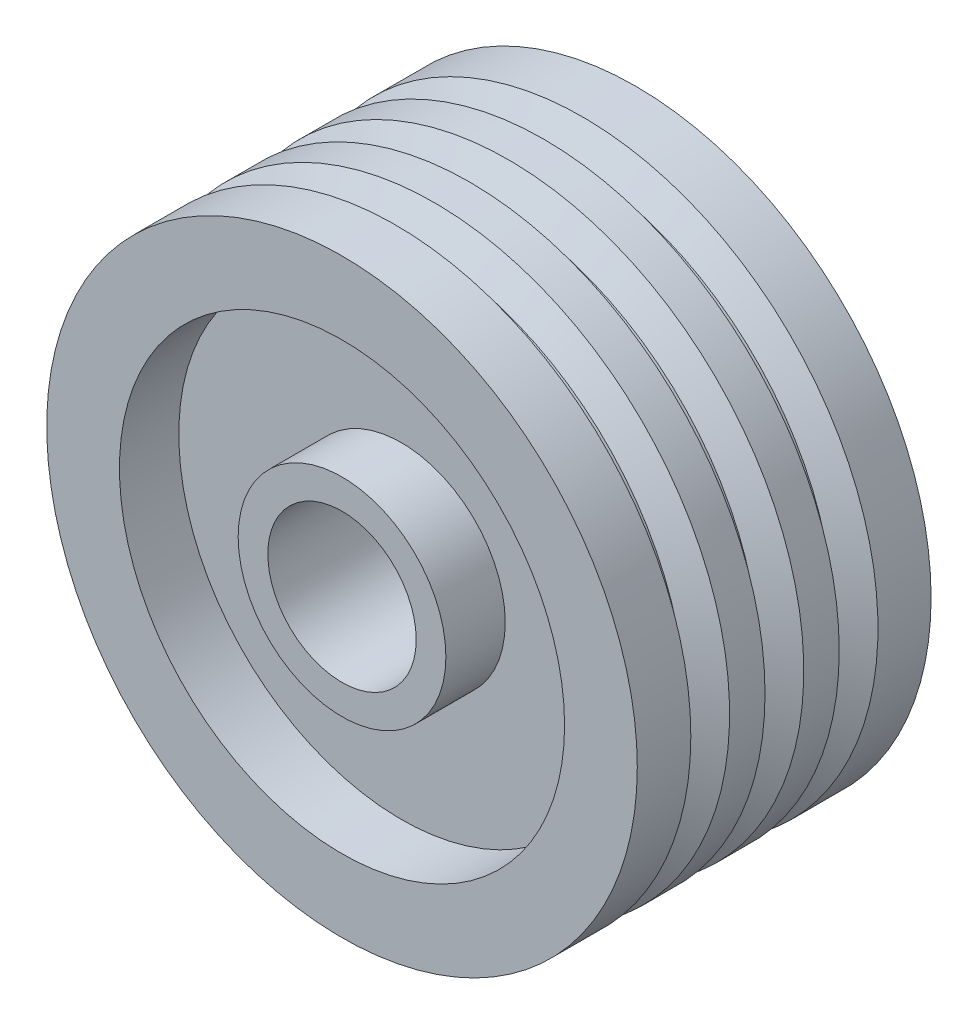
ISO-10303-21;
HEADER;
FILE_DESCRIPTION(('STEP AP214'),'2;1');
FILE_NAME('part.step','',(''),(''),'','','');
FILE_SCHEMA(('AUTOMOTIVE_DESIGN { 1 0 10303 214 1 1 1 1 }'));
ENDSEC;
DATA;
#1=APPLICATION_CONTEXT('core data for automotive mechanical design processes');
#2=APPLICATION_PROTOCOL_DEFINITION('international standard','automotive_design',2000,#1);
#3=PRODUCT_CONTEXT('',#1,'mechanical');
#4=PRODUCT('Part','Part','',(#3));
#5=PRODUCT_RELATED_PRODUCT_CATEGORY('part','',(#4));
#6=PRODUCT_DEFINITION_FORMATION('','',#4);
#7=PRODUCT_DEFINITION_CONTEXT('part definition',#1,'design');
#8=PRODUCT_DEFINITION('design','',#6,#7);
#9=PRODUCT_DEFINITION_SHAPE('','',#8);
#10=(LENGTH_UNIT() NAMED_UNIT(*) SI_UNIT(.MILLI.,.METRE.));
#11=(NAMED_UNIT(*) PLANE_ANGLE_UNIT() SI_UNIT($,.RADIAN.));
#12=(NAMED_UNIT(*) SI_UNIT($,.STERADIAN.) SOLID_ANGLE_UNIT());
#13=UNCERTAINTY_MEASURE_WITH_UNIT(LENGTH_MEASURE(1.E-05),#10,'distance_accuracy_value','');
#14=(GEOMETRIC_REPRESENTATION_CONTEXT(3) GLOBAL_UNCERTAINTY_ASSIGNED_CONTEXT((#13)) GLOBAL_UNIT_ASSIGNED_CONTEXT((#10,
#11,#12)) REPRESENTATION_CONTEXT('',''));
#15=CARTESIAN_POINT('',(0.,0.,0.));
#16=DIRECTION('',(0.,0.,1.));
#17=DIRECTION('',(1.,0.,0.));
#18=AXIS2_PLACEMENT_3D('',#15,#16,#17);
#19=CARTESIAN_POINT('',(0.,0.,49.5));
#20=DIRECTION('',(0.,0.,1.));
#21=DIRECTION('',(1.,0.,0.));
#22=AXIS2_PLACEMENT_3D('',#19,#20,#21);
#23=PLANE('',#22);
#24=CARTESIAN_POINT('',(0.,0.,49.5));
#25=DIRECTION('',(0.,0.,1.));
#26=DIRECTION('',(1.,0.,0.));
#27=AXIS2_PLACEMENT_3D('',#24,#25,#26);
#28=CIRCLE('',#27,25.);
#29=CARTESIAN_POINT('',(25.,0.,49.5));
#30=VERTEX_POINT('',#29);
#31=EDGE_CURVE('E139',#30,#30,#28,.T.);
#32=ORIENTED_EDGE('',*,*,#31,.F.);
#33=EDGE_LOOP('',(#32));
#34=FACE_BOUND('',#33,.T.);
#35=CARTESIAN_POINT('',(0.,0.,49.5));
#36=DIRECTION('',(0.,0.,1.));
#37=DIRECTION('',(1.,0.,0.));
#38=AXIS2_PLACEMENT_3D('',#35,#36,#37);
#39=CIRCLE('',#38,35.);
#40=CARTESIAN_POINT('',(35.,0.,49.5));
#41=VERTEX_POINT('',#40);
#42=EDGE_CURVE('E326',#41,#41,#39,.T.);
#43=ORIENTED_EDGE('',*,*,#42,.T.);
#44=EDGE_LOOP('',(#43));
#45=FACE_BOUND('',#44,.T.);
#46=ADVANCED_FACE('F32',(#34,#45),#23,.T.);
#47=CARTESIAN_POINT('',(0.,0.,49.5));
#48=DIRECTION('',(0.,0.,-1.));
#49=DIRECTION('',(-1.,0.,0.));
#50=AXIS2_PLACEMENT_3D('',#47,#48,#49);
#51=CYLINDRICAL_SURFACE('',#50,99.5);
#52=CARTESIAN_POINT('',(3.27580052842238E-13,0.,31.4581190718746));
#53=DIRECTION('',(0.,0.,1.));
#54=DIRECTION('',(1.,0.,0.));
#55=AXIS2_PLACEMENT_3D('',#52,#53,#54);
#56=CIRCLE('',#55,99.5);
#57=CARTESIAN_POINT('',(99.5000000000004,0.,31.4581190718735));
#58=VERTEX_POINT('',#57);
#59=EDGE_CURVE('E36',#58,#58,#56,.T.);
#60=ORIENTED_EDGE('',*,*,#59,.T.);
#61=EDGE_LOOP('',(#60));
#62=FACE_BOUND('',#61,.T.);
#63=CARTESIAN_POINT('',(0.,0.,49.5));
#64=DIRECTION('',(0.,0.,1.));
#65=DIRECTION('',(1.,0.,0.));
#66=AXIS2_PLACEMENT_3D('',#63,#64,#65);
#67=CIRCLE('',#66,99.5);
#68=CARTESIAN_POINT('',(99.5,0.,49.5));
#69=VERTEX_POINT('',#68);
#70=EDGE_CURVE('E10',#69,#69,#67,.T.);
#71=ORIENTED_EDGE('',*,*,#70,.F.);
#72=EDGE_LOOP('',(#71));
#73=FACE_BOUND('',#72,.T.);
#74=ADVANCED_FACE('F68',(#62,#73),#51,.T.);
#75=CARTESIAN_POINT('',(0.,0.,49.5));
#76=DIRECTION('',(0.,0.,1.));
#77=DIRECTION('',(1.,0.,0.));
#78=AXIS2_PLACEMENT_3D('',#75,#76,#77);
#79=CIRCLE('',#78,75.);
#80=CARTESIAN_POINT('',(75.,0.,49.5));
#81=VERTEX_POINT('',#80);
#82=EDGE_CURVE('E328',#81,#81,#79,.T.);
#83=ORIENTED_EDGE('',*,*,#82,.F.);
#84=EDGE_LOOP('',(#83));
#85=FACE_BOUND('',#84,.T.);
#86=ORIENTED_EDGE('',*,*,#70,.T.);
#87=EDGE_LOOP('',(#86));
#88=FACE_BOUND('',#87,.T.);
#89=ADVANCED_FACE('F74',(#85,#88),#23,.T.);
#90=CARTESIAN_POINT('',(3.30046354231417E-13,0.,31.6949625612591));
#91=DIRECTION('',(0.,0.,1.));
#92=DIRECTION('',(1.,0.,0.));
#93=AXIS2_PLACEMENT_3D('',#90,#91,#92);
#94=CONICAL_SURFACE('',#93,99.9117221224561,1.04877356801093);
#95=CARTESIAN_POINT('',(2.70564923737574E-13,0.,25.9828506460018));
#96=DIRECTION('',(0.,0.,-1.));
#97=DIRECTION('',(-1.,0.,0.));
#98=AXIS2_PLACEMENT_3D('',#95,#96,#97);
#99=CIRCLE('',#98,89.9819459332608);
#100=CARTESIAN_POINT('',(-89.9819459332605,0.,25.9828506460028));
#101=VERTEX_POINT('',#100);
#102=EDGE_CURVE('E157',#101,#101,#99,.T.);
#103=ORIENTED_EDGE('',*,*,#102,.F.);
#104=EDGE_LOOP('',(#103));
#105=FACE_BOUND('',#104,.T.);
#106=ORIENTED_EDGE('',*,*,#59,.F.);
#107=EDGE_LOOP('',(#106));
#108=FACE_BOUND('',#107,.T.);
#109=ADVANCED_FACE('F71',(#105,#108),#94,.T.);
#110=CARTESIAN_POINT('',(2.48811607737429E-13,0.,23.8938394287339));
#111=DIRECTION('',(0.,0.,-1.));
#112=DIRECTION('',(-1.,0.,0.));
#113=AXIS2_PLACEMENT_3D('',#110,#111,#112);
#114=CONICAL_SURFACE('',#113,90.0180540681299,1.04562153425965);
#115=CARTESIAN_POINT('',(2.48811607737429E-13,0.,23.8938394287339));
#116=DIRECTION('',(0.,0.,-1.));
#117=DIRECTION('',(-1.,0.,0.));
#118=AXIS2_PLACEMENT_3D('',#115,#116,#117);
#119=CIRCLE('',#118,90.0180540681299);
#120=CARTESIAN_POINT('',(-90.0180540681296,0.,23.8938394287349));
#121=VERTEX_POINT('',#120);
#122=EDGE_CURVE('E150',#121,#121,#119,.T.);
#123=ORIENTED_EDGE('',*,*,#122,.T.);
#124=EDGE_LOOP('',(#123));
#125=FACE_BOUND('',#124,.T.);
#126=CARTESIAN_POINT('',(1.91597807919002E-13,0.,18.3994922863294));
#127=DIRECTION('',(0.,0.,-1.));
#128=DIRECTION('',(-1.,0.,0.));
#129=AXIS2_PLACEMENT_3D('',#126,#127,#128);
#130=CIRCLE('',#129,99.5);
#131=CARTESIAN_POINT('',(-99.4999999999998,0.,18.3994922863304));
#132=VERTEX_POINT('',#131);
#133=EDGE_CURVE('E61',#132,#132,#130,.T.);
#134=ORIENTED_EDGE('',*,*,#133,.F.);
#135=EDGE_LOOP('',(#134));
#136=FACE_BOUND('',#135,.T.);
#137=ADVANCED_FACE('F73',(#125,#136),#114,.T.);
#138=CARTESIAN_POINT('',(2.70564923737574E-13,0.,25.9828506460018));
#139=DIRECTION('',(0.,0.,-1.));
#140=DIRECTION('',(-1.,0.,0.));
#141=AXIS2_PLACEMENT_3D('',#138,#139,#140);
#142=CONICAL_SURFACE('',#141,89.9819459332608,0.0172830759718585);
#143=ORIENTED_EDGE('',*,*,#122,.F.);
#144=EDGE_LOOP('',(#143));
#145=FACE_BOUND('',#144,.T.);
#146=ORIENTED_EDGE('',*,*,#102,.T.);
#147=EDGE_LOOP('',(#146));
#148=FACE_BOUND('',#147,.T.);
#149=ADVANCED_FACE('F81',(#145,#148),#142,.T.);
#150=ORIENTED_EDGE('',*,*,#133,.T.);
#151=EDGE_LOOP('',(#150));
#152=FACE_BOUND('',#151,.T.);
#153=CARTESIAN_POINT('',(0.,0.,6.45811907214413));
#154=DIRECTION('',(0.,0.,1.));
#155=DIRECTION('',(1.,0.,0.));
#156=AXIS2_PLACEMENT_3D('',#153,#154,#155);
#157=CIRCLE('',#156,99.5);
#158=CARTESIAN_POINT('',(99.5000000000001,0.,6.45811907214309));
#159=VERTEX_POINT('',#158);
#160=EDGE_CURVE('E53',#159,#159,#157,.T.);
#161=ORIENTED_EDGE('',*,*,#160,.T.);
#162=EDGE_LOOP('',(#161));
#163=FACE_BOUND('',#162,.T.);
#164=ADVANCED_FACE('F110',(#152,#163),#51,.T.);
#165=CARTESIAN_POINT('',(0.,0.,6.69496256152854));
#166=DIRECTION('',(0.,0.,1.));
#167=DIRECTION('',(1.,0.,0.));
#168=AXIS2_PLACEMENT_3D('',#165,#166,#167);
#169=CONICAL_SURFACE('',#168,99.9117221224559,1.04877356801093);
#170=CARTESIAN_POINT('',(0.,0.,0.982850646271287));
#171=DIRECTION('',(0.,0.,-1.));
#172=DIRECTION('',(-1.,0.,0.));
#173=AXIS2_PLACEMENT_3D('',#170,#171,#172);
#174=CIRCLE('',#173,89.9819459332606);
#175=CARTESIAN_POINT('',(-89.9819459332606,0.,0.982850646272224));
#176=VERTEX_POINT('',#175);
#177=EDGE_CURVE('E47',#176,#176,#174,.T.);
#178=ORIENTED_EDGE('',*,*,#177,.F.);
#179=EDGE_LOOP('',(#178));
#180=FACE_BOUND('',#179,.T.);
#181=ORIENTED_EDGE('',*,*,#160,.F.);
#182=EDGE_LOOP('',(#181));
#183=FACE_BOUND('',#182,.T.);
#184=ADVANCED_FACE('F171',(#180,#183),#169,.T.);
#185=CARTESIAN_POINT('',(0.,0.,-1.10616057125737));
#186=DIRECTION('',(0.,0.,-1.));
#187=DIRECTION('',(-1.,0.,0.));
#188=AXIS2_PLACEMENT_3D('',#185,#186,#187);
#189=CONICAL_SURFACE('',#188,90.0180540681253,1.04562153425909);
#190=CARTESIAN_POINT('',(0.,0.,-1.10616057125737));
#191=DIRECTION('',(0.,0.,-1.));
#192=DIRECTION('',(-1.,0.,0.));
#193=AXIS2_PLACEMENT_3D('',#190,#191,#192);
#194=CIRCLE('',#193,90.0180540681253);
#195=CARTESIAN_POINT('',(-90.0180540681253,0.,-1.10616057125643));
#196=VERTEX_POINT('',#195);
#197=EDGE_CURVE('E160',#196,#196,#194,.T.);
#198=ORIENTED_EDGE('',*,*,#197,.T.);
#199=EDGE_LOOP('',(#198));
#200=FACE_BOUND('',#199,.T.);
#201=CARTESIAN_POINT('',(0.,0.,-6.60050771367165));
#202=DIRECTION('',(0.,0.,-1.));
#203=DIRECTION('',(-1.,0.,0.));
#204=AXIS2_PLACEMENT_3D('',#201,#202,#203);
#205=CIRCLE('',#204,99.5);
#206=CARTESIAN_POINT('',(-99.5000000000001,0.,-6.60050771367062));
#207=VERTEX_POINT('',#206);
#208=EDGE_CURVE('E50',#207,#207,#205,.T.);
#209=ORIENTED_EDGE('',*,*,#208,.F.);
#210=EDGE_LOOP('',(#209));
#211=FACE_BOUND('',#210,.T.);
#212=ADVANCED_FACE('F174',(#200,#211),#189,.T.);
#213=CARTESIAN_POINT('',(0.,0.,0.982850646271287));
#214=DIRECTION('',(0.,0.,-1.));
#215=DIRECTION('',(-1.,0.,0.));
#216=AXIS2_PLACEMENT_3D('',#213,#214,#215);
#217=CONICAL_SURFACE('',#216,89.9819459332606,0.0172830759676031);
#218=ORIENTED_EDGE('',*,*,#197,.F.);
#219=EDGE_LOOP('',(#218));
#220=FACE_BOUND('',#219,.T.);
#221=ORIENTED_EDGE('',*,*,#177,.T.);
#222=EDGE_LOOP('',(#221));
#223=FACE_BOUND('',#222,.T.);
#224=ADVANCED_FACE('F97',(#220,#223),#217,.T.);
#225=CARTESIAN_POINT('',(-1.9308053098075E-13,0.,-18.5418809275863));
#226=DIRECTION('',(0.,0.,1.));
#227=DIRECTION('',(1.,0.,0.));
#228=AXIS2_PLACEMENT_3D('',#225,#226,#227);
#229=CIRCLE('',#228,99.5);
#230=CARTESIAN_POINT('',(99.4999999999998,0.,-18.5418809275874));
#231=VERTEX_POINT('',#230);
#232=EDGE_CURVE('E59',#231,#231,#229,.T.);
#233=ORIENTED_EDGE('',*,*,#232,.T.);
#234=EDGE_LOOP('',(#233));
#235=FACE_BOUND('',#234,.T.);
#236=ORIENTED_EDGE('',*,*,#208,.T.);
#237=EDGE_LOOP('',(#236));
#238=FACE_BOUND('',#237,.T.);
#239=ADVANCED_FACE('F93',(#235,#238),#51,.T.);
#240=CARTESIAN_POINT('',(-1.90614229591574E-13,0.,-18.305037438202));
#241=DIRECTION('',(0.,0.,1.));
#242=DIRECTION('',(1.,0.,0.));
#243=AXIS2_PLACEMENT_3D('',#240,#241,#242);
#244=CONICAL_SURFACE('',#243,99.9117221224557,1.04877356801093);
#245=CARTESIAN_POINT('',(-2.49888122029257E-13,0.,-23.997219089617));
#246=DIRECTION('',(0.,0.,-1.));
#247=DIRECTION('',(-1.,0.,0.));
#248=AXIS2_PLACEMENT_3D('',#245,#246,#247);
#249=CIRCLE('',#248,90.01659214858);
#250=CARTESIAN_POINT('',(-90.0165921485803,0.,-23.997219089616));
#251=VERTEX_POINT('',#250);
#252=EDGE_CURVE('E156',#251,#251,#249,.T.);
#253=ORIENTED_EDGE('',*,*,#252,.F.);
#254=EDGE_LOOP('',(#253));
#255=FACE_BOUND('',#254,.T.);
#256=ORIENTED_EDGE('',*,*,#232,.F.);
#257=EDGE_LOOP('',(#256));
#258=FACE_BOUND('',#257,.T.);
#259=ADVANCED_FACE('F183',(#255,#258),#244,.T.);
#260=CARTESIAN_POINT('',(-2.71848976090976E-13,0.,-26.1061605712472));
#261=DIRECTION('',(0.,0.,-1.));
#262=DIRECTION('',(-1.,0.,0.));
#263=AXIS2_PLACEMENT_3D('',#260,#261,#262);
#264=CONICAL_SURFACE('',#263,90.0180540681223,1.04562153425965);
#265=CARTESIAN_POINT('',(-2.71848976090976E-13,0.,-26.1061605712472));
#266=DIRECTION('',(0.,0.,-1.));
#267=DIRECTION('',(-1.,0.,0.));
#268=AXIS2_PLACEMENT_3D('',#265,#266,#267);
#269=CIRCLE('',#268,90.0180540681223);
#270=CARTESIAN_POINT('',(-90.0180540681225,0.,-26.1061605712462));
#271=VERTEX_POINT('',#270);
#272=EDGE_CURVE('E153',#271,#271,#269,.T.);
#273=ORIENTED_EDGE('',*,*,#272,.T.);
#274=EDGE_LOOP('',(#273));
#275=FACE_BOUND('',#274,.T.);
#276=CARTESIAN_POINT('',(-3.29062775909449E-13,0.,-31.6005077136561));
#277=DIRECTION('',(0.,0.,-1.));
#278=DIRECTION('',(-1.,0.,0.));
#279=AXIS2_PLACEMENT_3D('',#276,#277,#278);
#280=CIRCLE('',#279,99.5);
#281=CARTESIAN_POINT('',(-99.5000000000004,0.,-31.6005077136551));
#282=VERTEX_POINT('',#281);
#283=EDGE_CURVE('E56',#282,#282,#280,.T.);
#284=ORIENTED_EDGE('',*,*,#283,.F.);
#285=EDGE_LOOP('',(#284));
#286=FACE_BOUND('',#285,.T.);
#287=ADVANCED_FACE('F111',(#275,#286),#264,.T.);
#288=CARTESIAN_POINT('',(-2.49888122029257E-13,0.,-23.997219089617));
#289=DIRECTION('',(0.,0.,-1.));
#290=DIRECTION('',(-1.,0.,0.));
#291=AXIS2_PLACEMENT_3D('',#288,#289,#290);
#292=CONICAL_SURFACE('',#291,90.01659214858,0.00069320050877867);
#293=ORIENTED_EDGE('',*,*,#272,.F.);
#294=EDGE_LOOP('',(#293));
#295=FACE_BOUND('',#294,.T.);
#296=ORIENTED_EDGE('',*,*,#252,.T.);
#297=EDGE_LOOP('',(#296));
#298=FACE_BOUND('',#297,.T.);
#299=ADVANCED_FACE('F101',(#295,#298),#292,.T.);
#300=CARTESIAN_POINT('',(0.,0.,-49.5));
#301=DIRECTION('',(0.,0.,1.));
#302=DIRECTION('',(1.,0.,0.));
#303=AXIS2_PLACEMENT_3D('',#300,#301,#302);
#304=PLANE('',#303);
#305=CARTESIAN_POINT('',(0.,0.,-49.5));
#306=DIRECTION('',(0.,0.,-1.));
#307=DIRECTION('',(-1.,0.,0.));
#308=AXIS2_PLACEMENT_3D('',#305,#306,#307);
#309=CIRCLE('',#308,75.);
#310=CARTESIAN_POINT('',(-75.,0.,-49.5));
#311=VERTEX_POINT('',#310);
#312=EDGE_CURVE('E142',#311,#311,#309,.T.);
#313=ORIENTED_EDGE('',*,*,#312,.F.);
#314=EDGE_LOOP('',(#313));
#315=FACE_BOUND('',#314,.T.);
#316=CARTESIAN_POINT('',(0.,0.,-49.5));
#317=DIRECTION('',(0.,0.,1.));
#318=DIRECTION('',(1.,0.,0.));
#319=AXIS2_PLACEMENT_3D('',#316,#317,#318);
#320=CIRCLE('',#319,99.5);
#321=CARTESIAN_POINT('',(99.5,0.,-49.5));
#322=VERTEX_POINT('',#321);
#323=EDGE_CURVE('E40',#322,#322,#320,.T.);
#324=ORIENTED_EDGE('',*,*,#323,.F.);
#325=EDGE_LOOP('',(#324));
#326=FACE_BOUND('',#325,.T.);
#327=ADVANCED_FACE('F99',(#315,#326),#304,.F.);
#328=ORIENTED_EDGE('',*,*,#283,.T.);
#329=EDGE_LOOP('',(#328));
#330=FACE_BOUND('',#329,.T.);
#331=ORIENTED_EDGE('',*,*,#323,.T.);
#332=EDGE_LOOP('',(#331));
#333=FACE_BOUND('',#332,.T.);
#334=ADVANCED_FACE('F34',(#330,#333),#51,.T.);
#335=CARTESIAN_POINT('',(0.,0.,-29.5));
#336=DIRECTION('',(0.,0.,-1.));
#337=DIRECTION('',(-1.,0.,0.));
#338=AXIS2_PLACEMENT_3D('',#335,#336,#337);
#339=CYLINDRICAL_SURFACE('',#338,75.);
#340=CARTESIAN_POINT('',(0.,0.,-29.5));
#341=DIRECTION('',(0.,0.,-1.));
#342=DIRECTION('',(-1.,0.,0.));
#343=AXIS2_PLACEMENT_3D('',#340,#341,#342);
#344=CIRCLE('',#343,75.);
#345=CARTESIAN_POINT('',(-75.,0.,-29.5));
#346=VERTEX_POINT('',#345);
#347=EDGE_CURVE('E147',#346,#346,#344,.T.);
#348=ORIENTED_EDGE('',*,*,#347,.F.);
#349=EDGE_LOOP('',(#348));
#350=FACE_BOUND('',#349,.T.);
#351=ORIENTED_EDGE('',*,*,#312,.T.);
#352=EDGE_LOOP('',(#351));
#353=FACE_BOUND('',#352,.T.);
#354=ADVANCED_FACE('F108',(#350,#353),#339,.F.);
#355=CARTESIAN_POINT('',(0.,0.,-29.5));
#356=DIRECTION('',(0.,0.,-1.));
#357=DIRECTION('',(-1.,0.,0.));
#358=AXIS2_PLACEMENT_3D('',#355,#356,#357);
#359=PLANE('',#358);
#360=CARTESIAN_POINT('',(0.,0.,-29.5));
#361=DIRECTION('',(0.,0.,-1.));
#362=DIRECTION('',(-1.,0.,0.));
#363=AXIS2_PLACEMENT_3D('',#360,#361,#362);
#364=CIRCLE('',#363,35.);
#365=CARTESIAN_POINT('',(-35.,0.,-29.5));
#366=VERTEX_POINT('',#365);
#367=EDGE_CURVE('E138',#366,#366,#364,.T.);
#368=ORIENTED_EDGE('',*,*,#367,.F.);
#369=EDGE_LOOP('',(#368));
#370=FACE_BOUND('',#369,.T.);
#371=ORIENTED_EDGE('',*,*,#347,.T.);
#372=EDGE_LOOP('',(#371));
#373=FACE_BOUND('',#372,.T.);
#374=ADVANCED_FACE('F127',(#370,#373),#359,.T.);
#375=CARTESIAN_POINT('',(0.,0.,-29.5));
#376=DIRECTION('',(0.,0.,-1.));
#377=DIRECTION('',(-1.,0.,0.));
#378=AXIS2_PLACEMENT_3D('',#375,#376,#377);
#379=CYLINDRICAL_SURFACE('',#378,35.);
#380=ORIENTED_EDGE('',*,*,#367,.T.);
#381=EDGE_LOOP('',(#380));
#382=FACE_BOUND('',#381,.T.);
#383=CARTESIAN_POINT('',(0.,0.,-49.5));
#384=DIRECTION('',(0.,0.,-1.));
#385=DIRECTION('',(-1.,0.,0.));
#386=AXIS2_PLACEMENT_3D('',#383,#384,#385);
#387=CIRCLE('',#386,35.);
#388=CARTESIAN_POINT('',(-35.,0.,-49.5));
#389=VERTEX_POINT('',#388);
#390=EDGE_CURVE('E136',#389,#389,#387,.T.);
#391=ORIENTED_EDGE('',*,*,#390,.F.);
#392=EDGE_LOOP('',(#391));
#393=FACE_BOUND('',#392,.T.);
#394=ADVANCED_FACE('F118',(#382,#393),#379,.T.);
#395=CARTESIAN_POINT('',(0.,0.,-49.5));
#396=DIRECTION('',(0.,0.,1.));
#397=DIRECTION('',(1.,0.,0.));
#398=AXIS2_PLACEMENT_3D('',#395,#396,#397);
#399=CIRCLE('',#398,25.);
#400=CARTESIAN_POINT('',(25.,0.,-49.5));
#401=VERTEX_POINT('',#400);
#402=EDGE_CURVE('E133',#401,#401,#399,.T.);
#403=ORIENTED_EDGE('',*,*,#402,.T.);
#404=EDGE_LOOP('',(#403));
#405=FACE_BOUND('',#404,.T.);
#406=ORIENTED_EDGE('',*,*,#390,.T.);
#407=EDGE_LOOP('',(#406));
#408=FACE_BOUND('',#407,.T.);
#409=ADVANCED_FACE('F103',(#405,#408),#304,.F.);
#410=CARTESIAN_POINT('',(0.,0.,-49.5));
#411=DIRECTION('',(0.,0.,1.));
#412=DIRECTION('',(1.,0.,0.));
#413=AXIS2_PLACEMENT_3D('',#410,#411,#412);
#414=CYLINDRICAL_SURFACE('',#413,25.);
#415=ORIENTED_EDGE('',*,*,#31,.T.);
#416=EDGE_LOOP('',(#415));
#417=FACE_BOUND('',#416,.T.);
#418=ORIENTED_EDGE('',*,*,#402,.F.);
#419=EDGE_LOOP('',(#418));
#420=FACE_BOUND('',#419,.T.);
#421=ADVANCED_FACE('F117',(#417,#420),#414,.F.);
#422=CARTESIAN_POINT('',(0.,0.,29.5));
#423=DIRECTION('',(0.,0.,1.));
#424=DIRECTION('',(1.,0.,0.));
#425=AXIS2_PLACEMENT_3D('',#422,#423,#424);
#426=CYLINDRICAL_SURFACE('',#425,75.);
#427=CARTESIAN_POINT('',(0.,0.,29.5));
#428=DIRECTION('',(0.,0.,1.));
#429=DIRECTION('',(1.,0.,0.));
#430=AXIS2_PLACEMENT_3D('',#427,#428,#429);
#431=CIRCLE('',#430,75.);
#432=CARTESIAN_POINT('',(75.,0.,29.5));
#433=VERTEX_POINT('',#432);
#434=EDGE_CURVE('E331',#433,#433,#431,.T.);
#435=ORIENTED_EDGE('',*,*,#434,.F.);
#436=EDGE_LOOP('',(#435));
#437=FACE_BOUND('',#436,.T.);
#438=ORIENTED_EDGE('',*,*,#82,.T.);
#439=EDGE_LOOP('',(#438));
#440=FACE_BOUND('',#439,.T.);
#441=ADVANCED_FACE('F124',(#437,#440),#426,.F.);
#442=CARTESIAN_POINT('',(0.,0.,29.5));
#443=DIRECTION('',(0.,0.,1.));
#444=DIRECTION('',(1.,0.,0.));
#445=AXIS2_PLACEMENT_3D('',#442,#443,#444);
#446=PLANE('',#445);
#447=CARTESIAN_POINT('',(0.,0.,29.5));
#448=DIRECTION('',(0.,0.,1.));
#449=DIRECTION('',(1.,0.,0.));
#450=AXIS2_PLACEMENT_3D('',#447,#448,#449);
#451=CIRCLE('',#450,35.);
#452=CARTESIAN_POINT('',(35.,0.,29.5));
#453=VERTEX_POINT('',#452);
#454=EDGE_CURVE('E323',#453,#453,#451,.T.);
#455=ORIENTED_EDGE('',*,*,#454,.F.);
#456=EDGE_LOOP('',(#455));
#457=FACE_BOUND('',#456,.T.);
#458=ORIENTED_EDGE('',*,*,#434,.T.);
#459=EDGE_LOOP('',(#458));
#460=FACE_BOUND('',#459,.T.);
#461=ADVANCED_FACE('F296',(#457,#460),#446,.T.);
#462=CARTESIAN_POINT('',(0.,0.,29.5));
#463=DIRECTION('',(0.,0.,1.));
#464=DIRECTION('',(1.,0.,0.));
#465=AXIS2_PLACEMENT_3D('',#462,#463,#464);
#466=CYLINDRICAL_SURFACE('',#465,35.);
#467=ORIENTED_EDGE('',*,*,#454,.T.);
#468=EDGE_LOOP('',(#467));
#469=FACE_BOUND('',#468,.T.);
#470=ORIENTED_EDGE('',*,*,#42,.F.);
#471=EDGE_LOOP('',(#470));
#472=FACE_BOUND('',#471,.T.);
#473=ADVANCED_FACE('F306',(#469,#472),#466,.T.);
#474=CLOSED_SHELL('',(#46,#74,#89,#109,#137,#149,#164,#184,#212,#224,#239,#259,#287,#299,#327,
#334,#354,#374,#394,#409,#421,#441,#461,#473));
#475=MANIFOLD_SOLID_BREP('B2',#474);
#476=ADVANCED_BREP_SHAPE_REPRESENTATION('',(#18,#475),#14);
#477=SHAPE_DEFINITION_REPRESENTATION(#9,#476);
ENDSEC;
END-ISO-10303-21;
